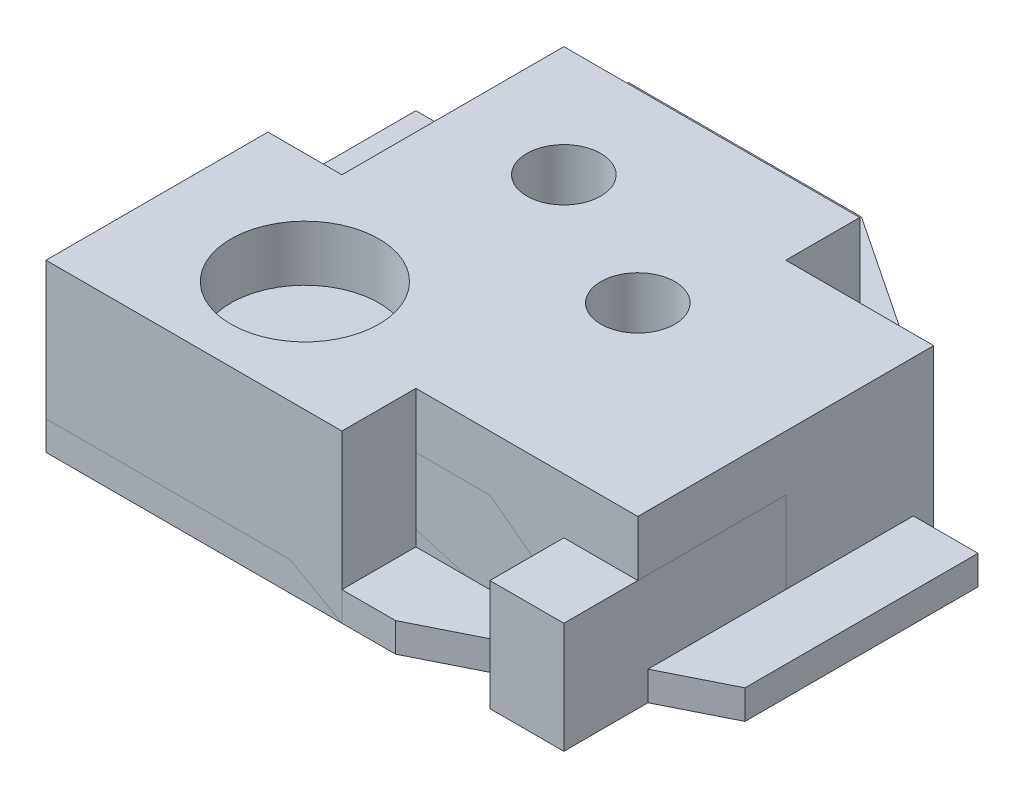
ISO-10303-21;
HEADER;
FILE_DESCRIPTION(('STEP AP214'),'2;1');
FILE_NAME('part.step','',(''),(''),'','','');
FILE_SCHEMA(('AUTOMOTIVE_DESIGN { 1 0 10303 214 1 1 1 1 }'));
ENDSEC;
DATA;
#1=APPLICATION_CONTEXT('core data for automotive mechanical design processes');
#2=APPLICATION_PROTOCOL_DEFINITION('international standard','automotive_design',2000,#1);
#3=PRODUCT_CONTEXT('',#1,'mechanical');
#4=PRODUCT('Part','Part','',(#3));
#5=PRODUCT_RELATED_PRODUCT_CATEGORY('part','',(#4));
#6=PRODUCT_DEFINITION_FORMATION('','',#4);
#7=PRODUCT_DEFINITION_CONTEXT('part definition',#1,'design');
#8=PRODUCT_DEFINITION('design','',#6,#7);
#9=PRODUCT_DEFINITION_SHAPE('','',#8);
#10=(LENGTH_UNIT() NAMED_UNIT(*) SI_UNIT(.MILLI.,.METRE.));
#11=(NAMED_UNIT(*) PLANE_ANGLE_UNIT() SI_UNIT($,.RADIAN.));
#12=(NAMED_UNIT(*) SI_UNIT($,.STERADIAN.) SOLID_ANGLE_UNIT());
#13=UNCERTAINTY_MEASURE_WITH_UNIT(LENGTH_MEASURE(1.E-05),#10,'distance_accuracy_value','');
#14=(GEOMETRIC_REPRESENTATION_CONTEXT(3) GLOBAL_UNCERTAINTY_ASSIGNED_CONTEXT((#13)) GLOBAL_UNIT_ASSIGNED_CONTEXT((#10,
#11,#12)) REPRESENTATION_CONTEXT('',''));
#15=CARTESIAN_POINT('',(0.,0.,0.));
#16=DIRECTION('',(0.,0.,1.));
#17=DIRECTION('',(1.,0.,0.));
#18=AXIS2_PLACEMENT_3D('',#15,#16,#17);
#19=CARTESIAN_POINT('',(0.,5.,0.));
#20=DIRECTION('',(0.,1.,0.));
#21=DIRECTION('',(0.,0.,1.));
#22=AXIS2_PLACEMENT_3D('',#19,#20,#21);
#23=PLANE('',#22);
#24=CARTESIAN_POINT('',(20.,5.,-20.));
#25=DIRECTION('',(0.,1.,0.));
#26=DIRECTION('',(0.,0.,1.));
#27=AXIS2_PLACEMENT_3D('',#24,#25,#26);
#28=CIRCLE('',#27,10.);
#29=CARTESIAN_POINT('',(20.,5.,-10.));
#30=VERTEX_POINT('',#29);
#31=EDGE_CURVE('E226',#30,#30,#28,.T.);
#32=ORIENTED_EDGE('',*,*,#31,.F.);
#33=EDGE_LOOP('',(#32));
#34=FACE_BOUND('',#33,.T.);
#35=DIRECTION('',(1.,0.,0.));
#36=VECTOR('',#35,1.);
#37=CARTESIAN_POINT('',(0.,5.,0.));
#38=LINE('',#37,#36);
#39=CARTESIAN_POINT('',(0.,5.,0.));
#40=VERTEX_POINT('',#39);
#41=CARTESIAN_POINT('',(60.,5.,0.));
#42=VERTEX_POINT('',#41);
#43=EDGE_CURVE('E177',#40,#42,#38,.T.);
#44=ORIENTED_EDGE('',*,*,#43,.T.);
#45=DIRECTION('',(0.894427190999916,0.,-0.447213595499958));
#46=VECTOR('',#45,1.);
#47=CARTESIAN_POINT('',(60.,5.,0.));
#48=LINE('',#47,#46);
#49=CARTESIAN_POINT('',(100.,5.,-20.));
#50=VERTEX_POINT('',#49);
#51=EDGE_CURVE('E113',#42,#50,#48,.T.);
#52=ORIENTED_EDGE('',*,*,#51,.T.);
#53=DIRECTION('',(0.,0.,-1.));
#54=VECTOR('',#53,1.);
#55=CARTESIAN_POINT('',(100.,5.,-20.));
#56=LINE('',#55,#54);
#57=CARTESIAN_POINT('',(100.,5.,-60.));
#58=VERTEX_POINT('',#57);
#59=EDGE_CURVE('E198',#50,#58,#56,.T.);
#60=ORIENTED_EDGE('',*,*,#59,.T.);
#61=DIRECTION('',(-1.,0.,0.));
#62=VECTOR('',#61,1.);
#63=CARTESIAN_POINT('',(100.,5.,-60.));
#64=LINE('',#63,#62);
#65=CARTESIAN_POINT('',(70.,5.,-60.));
#66=VERTEX_POINT('',#65);
#67=EDGE_CURVE('E212',#58,#66,#64,.T.);
#68=ORIENTED_EDGE('',*,*,#67,.T.);
#69=DIRECTION('',(0.,0.,-1.));
#70=VECTOR('',#69,1.);
#71=CARTESIAN_POINT('',(70.,5.,-60.));
#72=LINE('',#71,#70);
#73=CARTESIAN_POINT('',(70.,5.,-80.));
#74=VERTEX_POINT('',#73);
#75=EDGE_CURVE('E132',#66,#74,#72,.T.);
#76=ORIENTED_EDGE('',*,*,#75,.T.);
#77=DIRECTION('',(-0.832050294337844,0.,-0.554700196225229));
#78=VECTOR('',#77,1.);
#79=CARTESIAN_POINT('',(70.,5.,-80.));
#80=LINE('',#79,#78);
#81=CARTESIAN_POINT('',(40.,5.,-100.));
#82=VERTEX_POINT('',#81);
#83=EDGE_CURVE('E126',#74,#82,#80,.T.);
#84=ORIENTED_EDGE('',*,*,#83,.T.);
#85=DIRECTION('',(-1.,0.,0.));
#86=VECTOR('',#85,1.);
#87=CARTESIAN_POINT('',(0.,5.,-100.));
#88=LINE('',#87,#86);
#89=CARTESIAN_POINT('',(0.,5.,-100.));
#90=VERTEX_POINT('',#89);
#91=EDGE_CURVE('E130',#82,#90,#88,.T.);
#92=ORIENTED_EDGE('',*,*,#91,.T.);
#93=DIRECTION('',(0.,0.,1.));
#94=VECTOR('',#93,1.);
#95=CARTESIAN_POINT('',(0.,5.,0.));
#96=LINE('',#95,#94);
#97=EDGE_CURVE('E70',#90,#40,#96,.T.);
#98=ORIENTED_EDGE('',*,*,#97,.T.);
#99=EDGE_LOOP('',(#44,#52,#60,#68,#76,#84,#92,#98));
#100=FACE_BOUND('',#99,.T.);
#101=CARTESIAN_POINT('',(20.,5.,-80.));
#102=DIRECTION('',(0.,1.,0.));
#103=DIRECTION('',(0.,0.,1.));
#104=AXIS2_PLACEMENT_3D('',#101,#102,#103);
#105=CIRCLE('',#104,9.99999999999999);
#106=CARTESIAN_POINT('',(20.,5.,-70.));
#107=VERTEX_POINT('',#106);
#108=EDGE_CURVE('E159',#107,#107,#105,.T.);
#109=ORIENTED_EDGE('',*,*,#108,.F.);
#110=EDGE_LOOP('',(#109));
#111=FACE_BOUND('',#110,.T.);
#112=CARTESIAN_POINT('',(75.,5.,-30.));
#113=DIRECTION('',(0.,1.,0.));
#114=DIRECTION('',(0.,0.,1.));
#115=AXIS2_PLACEMENT_3D('',#112,#113,#114);
#116=CIRCLE('',#115,10.);
#117=CARTESIAN_POINT('',(75.,5.,-20.));
#118=VERTEX_POINT('',#117);
#119=EDGE_CURVE('E234',#118,#118,#116,.T.);
#120=ORIENTED_EDGE('',*,*,#119,.F.);
#121=EDGE_LOOP('',(#120));
#122=FACE_BOUND('',#121,.T.);
#123=ADVANCED_FACE('F52',(#34,#100,#111,#122),#23,.T.);
#124=CARTESIAN_POINT('',(0.,0.,0.));
#125=DIRECTION('',(0.,1.,0.));
#126=DIRECTION('',(0.,0.,1.));
#127=AXIS2_PLACEMENT_3D('',#124,#125,#126);
#128=PLANE('',#127);
#129=DIRECTION('',(1.,0.,0.));
#130=VECTOR('',#129,1.);
#131=CARTESIAN_POINT('',(0.,0.,0.));
#132=LINE('',#131,#130);
#133=CARTESIAN_POINT('',(0.,0.,0.));
#134=VERTEX_POINT('',#133);
#135=CARTESIAN_POINT('',(60.,0.,0.));
#136=VERTEX_POINT('',#135);
#137=EDGE_CURVE('E154',#134,#136,#132,.T.);
#138=ORIENTED_EDGE('',*,*,#137,.F.);
#139=DIRECTION('',(0.,0.,1.));
#140=VECTOR('',#139,1.);
#141=CARTESIAN_POINT('',(0.,0.,0.));
#142=LINE('',#141,#140);
#143=CARTESIAN_POINT('',(0.,0.,-100.));
#144=VERTEX_POINT('',#143);
#145=EDGE_CURVE('E105',#144,#134,#142,.T.);
#146=ORIENTED_EDGE('',*,*,#145,.F.);
#147=DIRECTION('',(-1.,0.,0.));
#148=VECTOR('',#147,1.);
#149=CARTESIAN_POINT('',(0.,0.,-100.));
#150=LINE('',#149,#148);
#151=CARTESIAN_POINT('',(40.,0.,-100.));
#152=VERTEX_POINT('',#151);
#153=EDGE_CURVE('E99',#152,#144,#150,.T.);
#154=ORIENTED_EDGE('',*,*,#153,.F.);
#155=DIRECTION('',(-0.832050294337844,0.,-0.554700196225229));
#156=VECTOR('',#155,1.);
#157=CARTESIAN_POINT('',(70.,0.,-80.));
#158=LINE('',#157,#156);
#159=CARTESIAN_POINT('',(70.,0.,-80.));
#160=VERTEX_POINT('',#159);
#161=EDGE_CURVE('E141',#160,#152,#158,.T.);
#162=ORIENTED_EDGE('',*,*,#161,.F.);
#163=DIRECTION('',(0.,0.,-1.));
#164=VECTOR('',#163,1.);
#165=CARTESIAN_POINT('',(70.,0.,-60.));
#166=LINE('',#165,#164);
#167=CARTESIAN_POINT('',(70.,0.,-60.));
#168=VERTEX_POINT('',#167);
#169=EDGE_CURVE('E168',#168,#160,#166,.T.);
#170=ORIENTED_EDGE('',*,*,#169,.F.);
#171=DIRECTION('',(-1.,0.,0.));
#172=VECTOR('',#171,1.);
#173=CARTESIAN_POINT('',(100.,0.,-60.));
#174=LINE('',#173,#172);
#175=CARTESIAN_POINT('',(100.,0.,-60.));
#176=VERTEX_POINT('',#175);
#177=EDGE_CURVE('E165',#176,#168,#174,.T.);
#178=ORIENTED_EDGE('',*,*,#177,.F.);
#179=DIRECTION('',(0.,0.,-1.));
#180=VECTOR('',#179,1.);
#181=CARTESIAN_POINT('',(100.,0.,-20.));
#182=LINE('',#181,#180);
#183=CARTESIAN_POINT('',(100.,0.,-20.));
#184=VERTEX_POINT('',#183);
#185=EDGE_CURVE('E162',#184,#176,#182,.T.);
#186=ORIENTED_EDGE('',*,*,#185,.F.);
#187=DIRECTION('',(0.894427190999916,0.,-0.447213595499958));
#188=VECTOR('',#187,1.);
#189=CARTESIAN_POINT('',(60.,0.,0.));
#190=LINE('',#189,#188);
#191=EDGE_CURVE('E158',#136,#184,#190,.T.);
#192=ORIENTED_EDGE('',*,*,#191,.F.);
#193=EDGE_LOOP('',(#138,#146,#154,#162,#170,#178,#186,#192));
#194=FACE_BOUND('',#193,.T.);
#195=CARTESIAN_POINT('',(20.,0.,-80.));
#196=DIRECTION('',(0.,1.,0.));
#197=DIRECTION('',(0.,0.,1.));
#198=AXIS2_PLACEMENT_3D('',#195,#196,#197);
#199=CIRCLE('',#198,9.99999999999999);
#200=CARTESIAN_POINT('',(20.,0.,-70.));
#201=VERTEX_POINT('',#200);
#202=EDGE_CURVE('E222',#201,#201,#199,.T.);
#203=ORIENTED_EDGE('',*,*,#202,.T.);
#204=EDGE_LOOP('',(#203));
#205=FACE_BOUND('',#204,.T.);
#206=CARTESIAN_POINT('',(20.,0.,-20.));
#207=DIRECTION('',(0.,1.,0.));
#208=DIRECTION('',(0.,0.,1.));
#209=AXIS2_PLACEMENT_3D('',#206,#207,#208);
#210=CIRCLE('',#209,10.);
#211=CARTESIAN_POINT('',(20.,0.,-10.));
#212=VERTEX_POINT('',#211);
#213=EDGE_CURVE('E230',#212,#212,#210,.T.);
#214=ORIENTED_EDGE('',*,*,#213,.T.);
#215=EDGE_LOOP('',(#214));
#216=FACE_BOUND('',#215,.T.);
#217=CARTESIAN_POINT('',(75.,0.,-30.));
#218=DIRECTION('',(0.,1.,0.));
#219=DIRECTION('',(0.,0.,1.));
#220=AXIS2_PLACEMENT_3D('',#217,#218,#219);
#221=CIRCLE('',#220,10.);
#222=CARTESIAN_POINT('',(75.,0.,-20.));
#223=VERTEX_POINT('',#222);
#224=EDGE_CURVE('E238',#223,#223,#221,.T.);
#225=ORIENTED_EDGE('',*,*,#224,.T.);
#226=EDGE_LOOP('',(#225));
#227=FACE_BOUND('',#226,.T.);
#228=ADVANCED_FACE('F202',(#194,#205,#216,#227),#128,.F.);
#229=CARTESIAN_POINT('',(0.,5.,0.));
#230=DIRECTION('',(0.,0.,-1.));
#231=DIRECTION('',(-1.,0.,0.));
#232=AXIS2_PLACEMENT_3D('',#229,#230,#231);
#233=PLANE('',#232);
#234=ORIENTED_EDGE('',*,*,#137,.T.);
#235=DIRECTION('',(0.,-1.,0.));
#236=VECTOR('',#235,1.);
#237=CARTESIAN_POINT('',(60.,5.,0.));
#238=LINE('',#237,#236);
#239=EDGE_CURVE('E12',#42,#136,#238,.T.);
#240=ORIENTED_EDGE('',*,*,#239,.F.);
#241=ORIENTED_EDGE('',*,*,#43,.F.);
#242=DIRECTION('',(0.,-1.,0.));
#243=VECTOR('',#242,1.);
#244=CARTESIAN_POINT('',(0.,5.,0.));
#245=LINE('',#244,#243);
#246=EDGE_CURVE('E150',#40,#134,#245,.T.);
#247=ORIENTED_EDGE('',*,*,#246,.T.);
#248=EDGE_LOOP('',(#234,#240,#241,#247));
#249=FACE_BOUND('',#248,.T.);
#250=ADVANCED_FACE('F54',(#249),#233,.F.);
#251=CARTESIAN_POINT('',(60.,5.,0.));
#252=DIRECTION('',(-0.447213595499958,0.,-0.894427190999916));
#253=DIRECTION('',(-0.894427190999916,0.,0.447213595499958));
#254=AXIS2_PLACEMENT_3D('',#251,#252,#253);
#255=PLANE('',#254);
#256=ORIENTED_EDGE('',*,*,#191,.T.);
#257=DIRECTION('',(0.,-1.,0.));
#258=VECTOR('',#257,1.);
#259=CARTESIAN_POINT('',(100.,5.,-20.));
#260=LINE('',#259,#258);
#261=EDGE_CURVE('E62',#50,#184,#260,.T.);
#262=ORIENTED_EDGE('',*,*,#261,.F.);
#263=ORIENTED_EDGE('',*,*,#51,.F.);
#264=ORIENTED_EDGE('',*,*,#239,.T.);
#265=EDGE_LOOP('',(#256,#262,#263,#264));
#266=FACE_BOUND('',#265,.T.);
#267=ADVANCED_FACE('F273',(#266),#255,.F.);
#268=CARTESIAN_POINT('',(100.,5.,-20.));
#269=DIRECTION('',(-1.,0.,0.));
#270=DIRECTION('',(0.,0.,1.));
#271=AXIS2_PLACEMENT_3D('',#268,#269,#270);
#272=PLANE('',#271);
#273=ORIENTED_EDGE('',*,*,#185,.T.);
#274=DIRECTION('',(0.,-1.,0.));
#275=VECTOR('',#274,1.);
#276=CARTESIAN_POINT('',(100.,5.,-60.));
#277=LINE('',#276,#275);
#278=EDGE_CURVE('E188',#58,#176,#277,.T.);
#279=ORIENTED_EDGE('',*,*,#278,.F.);
#280=ORIENTED_EDGE('',*,*,#59,.F.);
#281=ORIENTED_EDGE('',*,*,#261,.T.);
#282=EDGE_LOOP('',(#273,#279,#280,#281));
#283=FACE_BOUND('',#282,.T.);
#284=ADVANCED_FACE('F196',(#283),#272,.F.);
#285=CARTESIAN_POINT('',(100.,5.,-60.));
#286=DIRECTION('',(0.,0.,1.));
#287=DIRECTION('',(1.,0.,0.));
#288=AXIS2_PLACEMENT_3D('',#285,#286,#287);
#289=PLANE('',#288);
#290=ORIENTED_EDGE('',*,*,#177,.T.);
#291=DIRECTION('',(0.,-1.,0.));
#292=VECTOR('',#291,1.);
#293=CARTESIAN_POINT('',(70.,5.,-60.));
#294=LINE('',#293,#292);
#295=EDGE_CURVE('E184',#66,#168,#294,.T.);
#296=ORIENTED_EDGE('',*,*,#295,.F.);
#297=ORIENTED_EDGE('',*,*,#67,.F.);
#298=ORIENTED_EDGE('',*,*,#278,.T.);
#299=EDGE_LOOP('',(#290,#296,#297,#298));
#300=FACE_BOUND('',#299,.T.);
#301=ADVANCED_FACE('F207',(#300),#289,.F.);
#302=CARTESIAN_POINT('',(70.,5.,-60.));
#303=DIRECTION('',(-1.,0.,0.));
#304=DIRECTION('',(0.,0.,1.));
#305=AXIS2_PLACEMENT_3D('',#302,#303,#304);
#306=PLANE('',#305);
#307=ORIENTED_EDGE('',*,*,#169,.T.);
#308=DIRECTION('',(0.,-1.,0.));
#309=VECTOR('',#308,1.);
#310=CARTESIAN_POINT('',(70.,5.,-80.));
#311=LINE('',#310,#309);
#312=EDGE_CURVE('E143',#74,#160,#311,.T.);
#313=ORIENTED_EDGE('',*,*,#312,.F.);
#314=ORIENTED_EDGE('',*,*,#75,.F.);
#315=ORIENTED_EDGE('',*,*,#295,.T.);
#316=EDGE_LOOP('',(#307,#313,#314,#315));
#317=FACE_BOUND('',#316,.T.);
#318=ADVANCED_FACE('F210',(#317),#306,.F.);
#319=CARTESIAN_POINT('',(70.,5.,-80.));
#320=DIRECTION('',(-0.554700196225229,0.,0.832050294337844));
#321=DIRECTION('',(0.832050294337844,0.,0.554700196225229));
#322=AXIS2_PLACEMENT_3D('',#319,#320,#321);
#323=PLANE('',#322);
#324=ORIENTED_EDGE('',*,*,#161,.T.);
#325=DIRECTION('',(0.,-1.,0.));
#326=VECTOR('',#325,1.);
#327=CARTESIAN_POINT('',(40.,5.,-100.));
#328=LINE('',#327,#326);
#329=EDGE_CURVE('E138',#82,#152,#328,.T.);
#330=ORIENTED_EDGE('',*,*,#329,.F.);
#331=ORIENTED_EDGE('',*,*,#83,.F.);
#332=ORIENTED_EDGE('',*,*,#312,.T.);
#333=EDGE_LOOP('',(#324,#330,#331,#332));
#334=FACE_BOUND('',#333,.T.);
#335=ADVANCED_FACE('F139',(#334),#323,.F.);
#336=CARTESIAN_POINT('',(0.,5.,-100.));
#337=DIRECTION('',(0.,0.,1.));
#338=DIRECTION('',(1.,0.,0.));
#339=AXIS2_PLACEMENT_3D('',#336,#337,#338);
#340=PLANE('',#339);
#341=ORIENTED_EDGE('',*,*,#153,.T.);
#342=DIRECTION('',(0.,-1.,0.));
#343=VECTOR('',#342,1.);
#344=CARTESIAN_POINT('',(0.,5.,-100.));
#345=LINE('',#344,#343);
#346=EDGE_CURVE('E144',#90,#144,#345,.T.);
#347=ORIENTED_EDGE('',*,*,#346,.F.);
#348=ORIENTED_EDGE('',*,*,#91,.F.);
#349=ORIENTED_EDGE('',*,*,#329,.T.);
#350=EDGE_LOOP('',(#341,#347,#348,#349));
#351=FACE_BOUND('',#350,.T.);
#352=ADVANCED_FACE('F146',(#351),#340,.F.);
#353=CARTESIAN_POINT('',(0.,5.,0.));
#354=DIRECTION('',(1.,0.,0.));
#355=DIRECTION('',(0.,0.,-1.));
#356=AXIS2_PLACEMENT_3D('',#353,#354,#355);
#357=PLANE('',#356);
#358=ORIENTED_EDGE('',*,*,#145,.T.);
#359=ORIENTED_EDGE('',*,*,#246,.F.);
#360=ORIENTED_EDGE('',*,*,#97,.F.);
#361=ORIENTED_EDGE('',*,*,#346,.T.);
#362=EDGE_LOOP('',(#358,#359,#360,#361));
#363=FACE_BOUND('',#362,.T.);
#364=ADVANCED_FACE('F261',(#363),#357,.F.);
#365=CARTESIAN_POINT('',(20.,5.,-80.));
#366=DIRECTION('',(0.,-1.,0.));
#367=DIRECTION('',(0.,0.,-1.));
#368=AXIS2_PLACEMENT_3D('',#365,#366,#367);
#369=CYLINDRICAL_SURFACE('',#368,9.99999999999999);
#370=ORIENTED_EDGE('',*,*,#108,.T.);
#371=EDGE_LOOP('',(#370));
#372=FACE_BOUND('',#371,.T.);
#373=ORIENTED_EDGE('',*,*,#202,.F.);
#374=EDGE_LOOP('',(#373));
#375=FACE_BOUND('',#374,.T.);
#376=ADVANCED_FACE('F258',(#372,#375),#369,.F.);
#377=CARTESIAN_POINT('',(20.,5.,-20.));
#378=DIRECTION('',(0.,-1.,0.));
#379=DIRECTION('',(0.,0.,-1.));
#380=AXIS2_PLACEMENT_3D('',#377,#378,#379);
#381=CYLINDRICAL_SURFACE('',#380,10.);
#382=ORIENTED_EDGE('',*,*,#31,.T.);
#383=EDGE_LOOP('',(#382));
#384=FACE_BOUND('',#383,.T.);
#385=ORIENTED_EDGE('',*,*,#213,.F.);
#386=EDGE_LOOP('',(#385));
#387=FACE_BOUND('',#386,.T.);
#388=ADVANCED_FACE('F337',(#384,#387),#381,.F.);
#389=CARTESIAN_POINT('',(75.,5.,-30.));
#390=DIRECTION('',(0.,-1.,0.));
#391=DIRECTION('',(0.,0.,-1.));
#392=AXIS2_PLACEMENT_3D('',#389,#390,#391);
#393=CYLINDRICAL_SURFACE('',#392,10.);
#394=ORIENTED_EDGE('',*,*,#119,.T.);
#395=EDGE_LOOP('',(#394));
#396=FACE_BOUND('',#395,.T.);
#397=ORIENTED_EDGE('',*,*,#224,.F.);
#398=EDGE_LOOP('',(#397));
#399=FACE_BOUND('',#398,.T.);
#400=ADVANCED_FACE('F246',(#396,#399),#393,.F.);
#401=CLOSED_SHELL('',(#123,#228,#250,#267,#284,#301,#318,#335,#352,#364,#376,#388,#400));
#402=MANIFOLD_SOLID_BREP('B2',#401);
#403=CARTESIAN_POINT('',(0.,28.575,0.));
#404=DIRECTION('',(0.,1.,0.));
#405=DIRECTION('',(0.,0.,1.));
#406=AXIS2_PLACEMENT_3D('',#403,#404,#405);
#407=PLANE('',#406);
#408=CARTESIAN_POINT('',(57.15,28.575,-44.45));
#409=DIRECTION('',(0.,1.,0.));
#410=DIRECTION('',(0.,0.,1.));
#411=AXIS2_PLACEMENT_3D('',#408,#409,#410);
#412=CIRCLE('',#411,6.35);
#413=CARTESIAN_POINT('',(57.15,28.575,-38.1));
#414=VERTEX_POINT('',#413);
#415=EDGE_CURVE('E560',#414,#414,#412,.T.);
#416=ORIENTED_EDGE('',*,*,#415,.F.);
#417=EDGE_LOOP('',(#416));
#418=FACE_BOUND('',#417,.T.);
#419=DIRECTION('',(1.,0.,0.));
#420=VECTOR('',#419,1.);
#421=CARTESIAN_POINT('',(0.,28.575,0.));
#422=LINE('',#421,#420);
#423=CARTESIAN_POINT('',(0.,28.575,0.));
#424=VERTEX_POINT('',#423);
#425=CARTESIAN_POINT('',(50.8,28.575,0.));
#426=VERTEX_POINT('',#425);
#427=EDGE_CURVE('E509',#424,#426,#422,.T.);
#428=ORIENTED_EDGE('',*,*,#427,.T.);
#429=DIRECTION('',(0.,0.,-1.));
#430=VECTOR('',#429,1.);
#431=CARTESIAN_POINT('',(50.8,28.575,0.));
#432=LINE('',#431,#430);
#433=CARTESIAN_POINT('',(50.8,28.575,-12.7));
#434=VERTEX_POINT('',#433);
#435=EDGE_CURVE('E447',#426,#434,#432,.T.);
#436=ORIENTED_EDGE('',*,*,#435,.T.);
#437=DIRECTION('',(1.,0.,0.));
#438=VECTOR('',#437,1.);
#439=CARTESIAN_POINT('',(50.8,28.575,-12.7));
#440=LINE('',#439,#438);
#441=CARTESIAN_POINT('',(88.9,28.575,-12.7));
#442=VERTEX_POINT('',#441);
#443=EDGE_CURVE('E530',#434,#442,#440,.T.);
#444=ORIENTED_EDGE('',*,*,#443,.T.);
#445=DIRECTION('',(0.,0.,-1.));
#446=VECTOR('',#445,1.);
#447=CARTESIAN_POINT('',(88.9,28.575,-12.7));
#448=LINE('',#447,#446);
#449=CARTESIAN_POINT('',(88.9,28.575,-63.5));
#450=VERTEX_POINT('',#449);
#451=EDGE_CURVE('E549',#442,#450,#448,.T.);
#452=ORIENTED_EDGE('',*,*,#451,.T.);
#453=DIRECTION('',(-1.,0.,0.));
#454=VECTOR('',#453,1.);
#455=CARTESIAN_POINT('',(88.9,28.575,-63.5));
#456=LINE('',#455,#454);
#457=CARTESIAN_POINT('',(63.5,28.575,-63.5));
#458=VERTEX_POINT('',#457);
#459=EDGE_CURVE('E546',#450,#458,#456,.T.);
#460=ORIENTED_EDGE('',*,*,#459,.T.);
#461=DIRECTION('',(0.,0.,-1.));
#462=VECTOR('',#461,1.);
#463=CARTESIAN_POINT('',(63.5,28.575,-63.5));
#464=LINE('',#463,#462);
#465=CARTESIAN_POINT('',(63.5,28.575,-76.2));
#466=VERTEX_POINT('',#465);
#467=EDGE_CURVE('E548',#458,#466,#464,.T.);
#468=ORIENTED_EDGE('',*,*,#467,.T.);
#469=DIRECTION('',(-1.,0.,0.));
#470=VECTOR('',#469,1.);
#471=CARTESIAN_POINT('',(63.5,28.575,-76.2));
#472=LINE('',#471,#470);
#473=CARTESIAN_POINT('',(12.7,28.575,-76.2));
#474=VERTEX_POINT('',#473);
#475=EDGE_CURVE('E472',#466,#474,#472,.T.);
#476=ORIENTED_EDGE('',*,*,#475,.T.);
#477=DIRECTION('',(0.,0.,1.));
#478=VECTOR('',#477,1.);
#479=CARTESIAN_POINT('',(12.7,28.575,-38.1));
#480=LINE('',#479,#478);
#481=CARTESIAN_POINT('',(12.7,28.575,-38.1));
#482=VERTEX_POINT('',#481);
#483=EDGE_CURVE('E466',#474,#482,#480,.T.);
#484=ORIENTED_EDGE('',*,*,#483,.T.);
#485=DIRECTION('',(-1.,0.,0.));
#486=VECTOR('',#485,1.);
#487=CARTESIAN_POINT('',(0.,28.575,-38.1));
#488=LINE('',#487,#486);
#489=CARTESIAN_POINT('',(0.,28.575,-38.1));
#490=VERTEX_POINT('',#489);
#491=EDGE_CURVE('E470',#482,#490,#488,.T.);
#492=ORIENTED_EDGE('',*,*,#491,.T.);
#493=DIRECTION('',(0.,0.,1.));
#494=VECTOR('',#493,1.);
#495=CARTESIAN_POINT('',(0.,28.575,0.));
#496=LINE('',#495,#494);
#497=EDGE_CURVE('E398',#490,#424,#496,.T.);
#498=ORIENTED_EDGE('',*,*,#497,.T.);
#499=EDGE_LOOP('',(#428,#436,#444,#452,#460,#468,#476,#484,#492,#498));
#500=FACE_BOUND('',#499,.T.);
#501=CARTESIAN_POINT('',(25.4,28.575,-19.05));
#502=DIRECTION('',(0.,1.,0.));
#503=DIRECTION('',(0.,0.,1.));
#504=AXIS2_PLACEMENT_3D('',#501,#502,#503);
#505=CIRCLE('',#504,12.7);
#506=CARTESIAN_POINT('',(25.4,28.575,-6.35));
#507=VERTEX_POINT('',#506);
#508=EDGE_CURVE('E494',#507,#507,#505,.T.);
#509=ORIENTED_EDGE('',*,*,#508,.F.);
#510=EDGE_LOOP('',(#509));
#511=FACE_BOUND('',#510,.T.);
#512=CARTESIAN_POINT('',(31.75,28.575,-57.15));
#513=DIRECTION('',(0.,1.,0.));
#514=DIRECTION('',(0.,0.,1.));
#515=AXIS2_PLACEMENT_3D('',#512,#513,#514);
#516=CIRCLE('',#515,6.35);
#517=CARTESIAN_POINT('',(31.75,28.575,-50.8));
#518=VERTEX_POINT('',#517);
#519=EDGE_CURVE('E566',#518,#518,#516,.T.);
#520=ORIENTED_EDGE('',*,*,#519,.F.);
#521=EDGE_LOOP('',(#520));
#522=FACE_BOUND('',#521,.T.);
#523=ADVANCED_FACE('F381',(#418,#500,#511,#522),#407,.T.);
#524=CARTESIAN_POINT('',(0.,0.,0.));
#525=DIRECTION('',(0.,1.,0.));
#526=DIRECTION('',(0.,0.,1.));
#527=AXIS2_PLACEMENT_3D('',#524,#525,#526);
#528=PLANE('',#527);
#529=DIRECTION('',(1.,0.,0.));
#530=VECTOR('',#529,1.);
#531=CARTESIAN_POINT('',(0.,0.,0.));
#532=LINE('',#531,#530);
#533=CARTESIAN_POINT('',(0.,0.,0.));
#534=VERTEX_POINT('',#533);
#535=CARTESIAN_POINT('',(50.8,0.,0.));
#536=VERTEX_POINT('',#535);
#537=EDGE_CURVE('E490',#534,#536,#532,.T.);
#538=ORIENTED_EDGE('',*,*,#537,.F.);
#539=DIRECTION('',(0.,0.,1.));
#540=VECTOR('',#539,1.);
#541=CARTESIAN_POINT('',(0.,0.,0.));
#542=LINE('',#541,#540);
#543=CARTESIAN_POINT('',(0.,0.,-38.1));
#544=VERTEX_POINT('',#543);
#545=EDGE_CURVE('E439',#544,#534,#542,.T.);
#546=ORIENTED_EDGE('',*,*,#545,.F.);
#547=DIRECTION('',(-1.,0.,0.));
#548=VECTOR('',#547,1.);
#549=CARTESIAN_POINT('',(0.,0.,-38.1));
#550=LINE('',#549,#548);
#551=CARTESIAN_POINT('',(12.7,0.,-38.1));
#552=VERTEX_POINT('',#551);
#553=EDGE_CURVE('E433',#552,#544,#550,.T.);
#554=ORIENTED_EDGE('',*,*,#553,.F.);
#555=DIRECTION('',(0.,0.,1.));
#556=VECTOR('',#555,1.);
#557=CARTESIAN_POINT('',(12.7,0.,-38.1));
#558=LINE('',#557,#556);
#559=CARTESIAN_POINT('',(12.7,0.,-76.2));
#560=VERTEX_POINT('',#559);
#561=EDGE_CURVE('E480',#560,#552,#558,.T.);
#562=ORIENTED_EDGE('',*,*,#561,.F.);
#563=DIRECTION('',(-1.,0.,0.));
#564=VECTOR('',#563,1.);
#565=CARTESIAN_POINT('',(63.5,0.,-76.2));
#566=LINE('',#565,#564);
#567=CARTESIAN_POINT('',(63.5,0.,-76.2));
#568=VERTEX_POINT('',#567);
#569=EDGE_CURVE('E504',#568,#560,#566,.T.);
#570=ORIENTED_EDGE('',*,*,#569,.F.);
#571=DIRECTION('',(0.,0.,-1.));
#572=VECTOR('',#571,1.);
#573=CARTESIAN_POINT('',(63.5,0.,-63.5));
#574=LINE('',#573,#572);
#575=CARTESIAN_POINT('',(63.5,0.,-63.5));
#576=VERTEX_POINT('',#575);
#577=EDGE_CURVE('E502',#576,#568,#574,.T.);
#578=ORIENTED_EDGE('',*,*,#577,.F.);
#579=DIRECTION('',(-1.,0.,0.));
#580=VECTOR('',#579,1.);
#581=CARTESIAN_POINT('',(88.9,0.,-63.5));
#582=LINE('',#581,#580);
#583=CARTESIAN_POINT('',(88.9,0.,-63.5));
#584=VERTEX_POINT('',#583);
#585=EDGE_CURVE('E500',#584,#576,#582,.T.);
#586=ORIENTED_EDGE('',*,*,#585,.F.);
#587=DIRECTION('',(0.,0.,-1.));
#588=VECTOR('',#587,1.);
#589=CARTESIAN_POINT('',(88.9,0.,-12.7));
#590=LINE('',#589,#588);
#591=CARTESIAN_POINT('',(88.9,0.,-12.7));
#592=VERTEX_POINT('',#591);
#593=EDGE_CURVE('E498',#592,#584,#590,.T.);
#594=ORIENTED_EDGE('',*,*,#593,.F.);
#595=DIRECTION('',(1.,0.,0.));
#596=VECTOR('',#595,1.);
#597=CARTESIAN_POINT('',(50.8,0.,-12.7));
#598=LINE('',#597,#596);
#599=CARTESIAN_POINT('',(50.8,0.,-12.7));
#600=VERTEX_POINT('',#599);
#601=EDGE_CURVE('E496',#600,#592,#598,.T.);
#602=ORIENTED_EDGE('',*,*,#601,.F.);
#603=DIRECTION('',(0.,0.,-1.));
#604=VECTOR('',#603,1.);
#605=CARTESIAN_POINT('',(50.8,0.,0.));
#606=LINE('',#605,#604);
#607=EDGE_CURVE('E493',#536,#600,#606,.T.);
#608=ORIENTED_EDGE('',*,*,#607,.F.);
#609=EDGE_LOOP('',(#538,#546,#554,#562,#570,#578,#586,#594,#602,#608));
#610=FACE_BOUND('',#609,.T.);
#611=CARTESIAN_POINT('',(25.4,0.,-19.05));
#612=DIRECTION('',(0.,1.,0.));
#613=DIRECTION('',(0.,0.,1.));
#614=AXIS2_PLACEMENT_3D('',#611,#612,#613);
#615=CIRCLE('',#614,12.7);
#616=CARTESIAN_POINT('',(25.4,0.,-6.35));
#617=VERTEX_POINT('',#616);
#618=EDGE_CURVE('E557',#617,#617,#615,.T.);
#619=ORIENTED_EDGE('',*,*,#618,.T.);
#620=EDGE_LOOP('',(#619));
#621=FACE_BOUND('',#620,.T.);
#622=CARTESIAN_POINT('',(57.15,0.,-44.45));
#623=DIRECTION('',(0.,1.,0.));
#624=DIRECTION('',(0.,0.,1.));
#625=AXIS2_PLACEMENT_3D('',#622,#623,#624);
#626=CIRCLE('',#625,6.35);
#627=CARTESIAN_POINT('',(57.15,0.,-38.1));
#628=VERTEX_POINT('',#627);
#629=EDGE_CURVE('E563',#628,#628,#626,.T.);
#630=ORIENTED_EDGE('',*,*,#629,.T.);
#631=EDGE_LOOP('',(#630));
#632=FACE_BOUND('',#631,.T.);
#633=CARTESIAN_POINT('',(31.75,0.,-57.15));
#634=DIRECTION('',(0.,1.,0.));
#635=DIRECTION('',(0.,0.,1.));
#636=AXIS2_PLACEMENT_3D('',#633,#634,#635);
#637=CIRCLE('',#636,6.35);
#638=CARTESIAN_POINT('',(31.75,0.,-50.8));
#639=VERTEX_POINT('',#638);
#640=EDGE_CURVE('E569',#639,#639,#637,.T.);
#641=ORIENTED_EDGE('',*,*,#640,.T.);
#642=EDGE_LOOP('',(#641));
#643=FACE_BOUND('',#642,.T.);
#644=ADVANCED_FACE('F534',(#610,#621,#632,#643),#528,.F.);
#645=CARTESIAN_POINT('',(0.,28.575,0.));
#646=DIRECTION('',(0.,0.,-1.));
#647=DIRECTION('',(-1.,0.,0.));
#648=AXIS2_PLACEMENT_3D('',#645,#646,#647);
#649=PLANE('',#648);
#650=ORIENTED_EDGE('',*,*,#537,.T.);
#651=DIRECTION('',(0.,-1.,0.));
#652=VECTOR('',#651,1.);
#653=CARTESIAN_POINT('',(50.8,28.575,0.));
#654=LINE('',#653,#652);
#655=EDGE_CURVE('E50',#426,#536,#654,.T.);
#656=ORIENTED_EDGE('',*,*,#655,.F.);
#657=ORIENTED_EDGE('',*,*,#427,.F.);
#658=DIRECTION('',(0.,-1.,0.));
#659=VECTOR('',#658,1.);
#660=CARTESIAN_POINT('',(0.,28.575,0.));
#661=LINE('',#660,#659);
#662=EDGE_CURVE('E486',#424,#534,#661,.T.);
#663=ORIENTED_EDGE('',*,*,#662,.T.);
#664=EDGE_LOOP('',(#650,#656,#657,#663));
#665=FACE_BOUND('',#664,.T.);
#666=ADVANCED_FACE('F383',(#665),#649,.F.);
#667=CARTESIAN_POINT('',(50.8,28.575,0.));
#668=DIRECTION('',(-1.,0.,0.));
#669=DIRECTION('',(0.,0.,1.));
#670=AXIS2_PLACEMENT_3D('',#667,#668,#669);
#671=PLANE('',#670);
#672=ORIENTED_EDGE('',*,*,#607,.T.);
#673=DIRECTION('',(0.,-1.,0.));
#674=VECTOR('',#673,1.);
#675=CARTESIAN_POINT('',(50.8,28.575,-12.7));
#676=LINE('',#675,#674);
#677=EDGE_CURVE('E390',#434,#600,#676,.T.);
#678=ORIENTED_EDGE('',*,*,#677,.F.);
#679=ORIENTED_EDGE('',*,*,#435,.F.);
#680=ORIENTED_EDGE('',*,*,#655,.T.);
#681=EDGE_LOOP('',(#672,#678,#679,#680));
#682=FACE_BOUND('',#681,.T.);
#683=ADVANCED_FACE('F610',(#682),#671,.F.);
#684=CARTESIAN_POINT('',(50.8,28.575,-12.7));
#685=DIRECTION('',(0.,0.,-1.));
#686=DIRECTION('',(-1.,0.,0.));
#687=AXIS2_PLACEMENT_3D('',#684,#685,#686);
#688=PLANE('',#687);
#689=ORIENTED_EDGE('',*,*,#601,.T.);
#690=DIRECTION('',(0.,-1.,0.));
#691=VECTOR('',#690,1.);
#692=CARTESIAN_POINT('',(88.9,28.575,-12.7));
#693=LINE('',#692,#691);
#694=EDGE_CURVE('E522',#442,#592,#693,.T.);
#695=ORIENTED_EDGE('',*,*,#694,.F.);
#696=ORIENTED_EDGE('',*,*,#443,.F.);
#697=ORIENTED_EDGE('',*,*,#677,.T.);
#698=EDGE_LOOP('',(#689,#695,#696,#697));
#699=FACE_BOUND('',#698,.T.);
#700=ADVANCED_FACE('F528',(#699),#688,.F.);
#701=CARTESIAN_POINT('',(88.9,28.575,-12.7));
#702=DIRECTION('',(-1.,0.,0.));
#703=DIRECTION('',(0.,0.,1.));
#704=AXIS2_PLACEMENT_3D('',#701,#702,#703);
#705=PLANE('',#704);
#706=ORIENTED_EDGE('',*,*,#593,.T.);
#707=DIRECTION('',(0.,-1.,0.));
#708=VECTOR('',#707,1.);
#709=CARTESIAN_POINT('',(88.9,28.575,-63.5));
#710=LINE('',#709,#708);
#711=EDGE_CURVE('E519',#450,#584,#710,.T.);
#712=ORIENTED_EDGE('',*,*,#711,.F.);
#713=ORIENTED_EDGE('',*,*,#451,.F.);
#714=ORIENTED_EDGE('',*,*,#694,.T.);
#715=EDGE_LOOP('',(#706,#712,#713,#714));
#716=FACE_BOUND('',#715,.T.);
#717=ADVANCED_FACE('F540',(#716),#705,.F.);
#718=CARTESIAN_POINT('',(88.9,28.575,-63.5));
#719=DIRECTION('',(0.,0.,1.));
#720=DIRECTION('',(1.,0.,0.));
#721=AXIS2_PLACEMENT_3D('',#718,#719,#720);
#722=PLANE('',#721);
#723=ORIENTED_EDGE('',*,*,#585,.T.);
#724=DIRECTION('',(0.,-1.,0.));
#725=VECTOR('',#724,1.);
#726=CARTESIAN_POINT('',(63.5,28.575,-63.5));
#727=LINE('',#726,#725);
#728=EDGE_CURVE('E516',#458,#576,#727,.T.);
#729=ORIENTED_EDGE('',*,*,#728,.F.);
#730=ORIENTED_EDGE('',*,*,#459,.F.);
#731=ORIENTED_EDGE('',*,*,#711,.T.);
#732=EDGE_LOOP('',(#723,#729,#730,#731));
#733=FACE_BOUND('',#732,.T.);
#734=ADVANCED_FACE('F544',(#733),#722,.F.);
#735=CARTESIAN_POINT('',(63.5,28.575,-63.5));
#736=DIRECTION('',(-1.,0.,0.));
#737=DIRECTION('',(0.,0.,1.));
#738=AXIS2_PLACEMENT_3D('',#735,#736,#737);
#739=PLANE('',#738);
#740=ORIENTED_EDGE('',*,*,#577,.T.);
#741=DIRECTION('',(0.,-1.,0.));
#742=VECTOR('',#741,1.);
#743=CARTESIAN_POINT('',(63.5,28.575,-76.2));
#744=LINE('',#743,#742);
#745=EDGE_CURVE('E513',#466,#568,#744,.T.);
#746=ORIENTED_EDGE('',*,*,#745,.F.);
#747=ORIENTED_EDGE('',*,*,#467,.F.);
#748=ORIENTED_EDGE('',*,*,#728,.T.);
#749=EDGE_LOOP('',(#740,#746,#747,#748));
#750=FACE_BOUND('',#749,.T.);
#751=ADVANCED_FACE('F600',(#750),#739,.F.);
#752=CARTESIAN_POINT('',(63.5,28.575,-76.2));
#753=DIRECTION('',(0.,0.,1.));
#754=DIRECTION('',(1.,0.,0.));
#755=AXIS2_PLACEMENT_3D('',#752,#753,#754);
#756=PLANE('',#755);
#757=ORIENTED_EDGE('',*,*,#569,.T.);
#758=DIRECTION('',(0.,-1.,0.));
#759=VECTOR('',#758,1.);
#760=CARTESIAN_POINT('',(12.7,28.575,-76.2));
#761=LINE('',#760,#759);
#762=EDGE_CURVE('E481',#474,#560,#761,.T.);
#763=ORIENTED_EDGE('',*,*,#762,.F.);
#764=ORIENTED_EDGE('',*,*,#475,.F.);
#765=ORIENTED_EDGE('',*,*,#745,.T.);
#766=EDGE_LOOP('',(#757,#763,#764,#765));
#767=FACE_BOUND('',#766,.T.);
#768=ADVANCED_FACE('F597',(#767),#756,.F.);
#769=CARTESIAN_POINT('',(12.7,28.575,-38.1));
#770=DIRECTION('',(1.,0.,0.));
#771=DIRECTION('',(0.,0.,-1.));
#772=AXIS2_PLACEMENT_3D('',#769,#770,#771);
#773=PLANE('',#772);
#774=ORIENTED_EDGE('',*,*,#561,.T.);
#775=DIRECTION('',(0.,-1.,0.));
#776=VECTOR('',#775,1.);
#777=CARTESIAN_POINT('',(12.7,28.575,-38.1));
#778=LINE('',#777,#776);
#779=EDGE_CURVE('E477',#482,#552,#778,.T.);
#780=ORIENTED_EDGE('',*,*,#779,.F.);
#781=ORIENTED_EDGE('',*,*,#483,.F.);
#782=ORIENTED_EDGE('',*,*,#762,.T.);
#783=EDGE_LOOP('',(#774,#780,#781,#782));
#784=FACE_BOUND('',#783,.T.);
#785=ADVANCED_FACE('F478',(#784),#773,.F.);
#786=CARTESIAN_POINT('',(0.,28.575,-38.1));
#787=DIRECTION('',(0.,0.,1.));
#788=DIRECTION('',(1.,0.,0.));
#789=AXIS2_PLACEMENT_3D('',#786,#787,#788);
#790=PLANE('',#789);
#791=ORIENTED_EDGE('',*,*,#553,.T.);
#792=DIRECTION('',(0.,-1.,0.));
#793=VECTOR('',#792,1.);
#794=CARTESIAN_POINT('',(0.,28.575,-38.1));
#795=LINE('',#794,#793);
#796=EDGE_CURVE('E482',#490,#544,#795,.T.);
#797=ORIENTED_EDGE('',*,*,#796,.F.);
#798=ORIENTED_EDGE('',*,*,#491,.F.);
#799=ORIENTED_EDGE('',*,*,#779,.T.);
#800=EDGE_LOOP('',(#791,#797,#798,#799));
#801=FACE_BOUND('',#800,.T.);
#802=ADVANCED_FACE('F484',(#801),#790,.F.);
#803=CARTESIAN_POINT('',(0.,28.575,0.));
#804=DIRECTION('',(1.,0.,0.));
#805=DIRECTION('',(0.,0.,-1.));
#806=AXIS2_PLACEMENT_3D('',#803,#804,#805);
#807=PLANE('',#806);
#808=ORIENTED_EDGE('',*,*,#545,.T.);
#809=ORIENTED_EDGE('',*,*,#662,.F.);
#810=ORIENTED_EDGE('',*,*,#497,.F.);
#811=ORIENTED_EDGE('',*,*,#796,.T.);
#812=EDGE_LOOP('',(#808,#809,#810,#811));
#813=FACE_BOUND('',#812,.T.);
#814=ADVANCED_FACE('F590',(#813),#807,.F.);
#815=CARTESIAN_POINT('',(25.4,28.575,-19.05));
#816=DIRECTION('',(0.,-1.,0.));
#817=DIRECTION('',(0.,0.,-1.));
#818=AXIS2_PLACEMENT_3D('',#815,#816,#817);
#819=CYLINDRICAL_SURFACE('',#818,12.7);
#820=ORIENTED_EDGE('',*,*,#508,.T.);
#821=EDGE_LOOP('',(#820));
#822=FACE_BOUND('',#821,.T.);
#823=ORIENTED_EDGE('',*,*,#618,.F.);
#824=EDGE_LOOP('',(#823));
#825=FACE_BOUND('',#824,.T.);
#826=ADVANCED_FACE('F587',(#822,#825),#819,.F.);
#827=CARTESIAN_POINT('',(57.15,28.575,-44.45));
#828=DIRECTION('',(0.,-1.,0.));
#829=DIRECTION('',(0.,0.,-1.));
#830=AXIS2_PLACEMENT_3D('',#827,#828,#829);
#831=CYLINDRICAL_SURFACE('',#830,6.35);
#832=ORIENTED_EDGE('',*,*,#415,.T.);
#833=EDGE_LOOP('',(#832));
#834=FACE_BOUND('',#833,.T.);
#835=ORIENTED_EDGE('',*,*,#629,.F.);
#836=EDGE_LOOP('',(#835));
#837=FACE_BOUND('',#836,.T.);
#838=ADVANCED_FACE('F686',(#834,#837),#831,.F.);
#839=CARTESIAN_POINT('',(31.75,28.575,-57.15));
#840=DIRECTION('',(0.,-1.,0.));
#841=DIRECTION('',(0.,0.,-1.));
#842=AXIS2_PLACEMENT_3D('',#839,#840,#841);
#843=CYLINDRICAL_SURFACE('',#842,6.35);
#844=ORIENTED_EDGE('',*,*,#519,.T.);
#845=EDGE_LOOP('',(#844));
#846=FACE_BOUND('',#845,.T.);
#847=ORIENTED_EDGE('',*,*,#640,.F.);
#848=EDGE_LOOP('',(#847));
#849=FACE_BOUND('',#848,.T.);
#850=ADVANCED_FACE('F575',(#846,#849),#843,.F.);
#851=CLOSED_SHELL('',(#523,#644,#666,#683,#700,#717,#734,#751,#768,#785,#802,#814,#826,#838,#850));
#852=MANIFOLD_SOLID_BREP('B6_NOT_SHOWN',#851);
#853=CARTESIAN_POINT('',(0.,19.05,0.));
#854=DIRECTION('',(0.,1.,0.));
#855=DIRECTION('',(0.,0.,1.));
#856=AXIS2_PLACEMENT_3D('',#853,#854,#855);
#857=PLANE('',#856);
#858=CARTESIAN_POINT('',(25.4,19.05,-38.1));
#859=DIRECTION('',(0.,1.,0.));
#860=DIRECTION('',(0.,0.,1.));
#861=AXIS2_PLACEMENT_3D('',#858,#859,#860);
#862=CIRCLE('',#861,6.35);
#863=CARTESIAN_POINT('',(25.4,19.05,-31.75));
#864=VERTEX_POINT('',#863);
#865=EDGE_CURVE('E830',#864,#864,#862,.T.);
#866=ORIENTED_EDGE('',*,*,#865,.F.);
#867=EDGE_LOOP('',(#866));
#868=FACE_BOUND('',#867,.T.);
#869=DIRECTION('',(1.,0.,0.));
#870=VECTOR('',#869,1.);
#871=CARTESIAN_POINT('',(0.,19.05,0.));
#872=LINE('',#871,#870);
#873=CARTESIAN_POINT('',(0.,19.05,0.));
#874=VERTEX_POINT('',#873);
#875=CARTESIAN_POINT('',(12.7,19.05,0.));
#876=VERTEX_POINT('',#875);
#877=EDGE_CURVE('E843',#874,#876,#872,.T.);
#878=ORIENTED_EDGE('',*,*,#877,.T.);
#879=DIRECTION('',(0.,0.,-1.));
#880=VECTOR('',#879,1.);
#881=CARTESIAN_POINT('',(12.7,19.05,0.));
#882=LINE('',#881,#880);
#883=CARTESIAN_POINT('',(12.7,19.05,-12.7));
#884=VERTEX_POINT('',#883);
#885=EDGE_CURVE('E786',#876,#884,#882,.T.);
#886=ORIENTED_EDGE('',*,*,#885,.T.);
#887=DIRECTION('',(1.,0.,0.));
#888=VECTOR('',#887,1.);
#889=CARTESIAN_POINT('',(12.7,19.05,-12.7));
#890=LINE('',#889,#888);
#891=CARTESIAN_POINT('',(76.2,19.05,-12.7));
#892=VERTEX_POINT('',#891);
#893=EDGE_CURVE('E861',#884,#892,#890,.T.);
#894=ORIENTED_EDGE('',*,*,#893,.T.);
#895=DIRECTION('',(0.,0.,1.));
#896=VECTOR('',#895,1.);
#897=CARTESIAN_POINT('',(76.2,19.05,-12.7));
#898=LINE('',#897,#896);
#899=CARTESIAN_POINT('',(76.2,19.05,0.));
#900=VERTEX_POINT('',#899);
#901=EDGE_CURVE('E878',#892,#900,#898,.T.);
#902=ORIENTED_EDGE('',*,*,#901,.T.);
#903=DIRECTION('',(1.,0.,0.));
#904=VECTOR('',#903,1.);
#905=CARTESIAN_POINT('',(76.2,19.05,0.));
#906=LINE('',#905,#904);
#907=CARTESIAN_POINT('',(88.9,19.05,0.));
#908=VERTEX_POINT('',#907);
#909=EDGE_CURVE('E877',#900,#908,#906,.T.);
#910=ORIENTED_EDGE('',*,*,#909,.T.);
#911=DIRECTION('',(0.,0.,-1.));
#912=VECTOR('',#911,1.);
#913=CARTESIAN_POINT('',(88.9,19.05,0.));
#914=LINE('',#913,#912);
#915=CARTESIAN_POINT('',(88.9,19.05,-38.1));
#916=VERTEX_POINT('',#915);
#917=EDGE_CURVE('E808',#908,#916,#914,.T.);
#918=ORIENTED_EDGE('',*,*,#917,.T.);
#919=DIRECTION('',(-0.832050294337844,0.,-0.554700196225229));
#920=VECTOR('',#919,1.);
#921=CARTESIAN_POINT('',(88.9,19.05,-38.1));
#922=LINE('',#921,#920);
#923=CARTESIAN_POINT('',(50.8,19.05,-63.5));
#924=VERTEX_POINT('',#923);
#925=EDGE_CURVE('E802',#916,#924,#922,.T.);
#926=ORIENTED_EDGE('',*,*,#925,.T.);
#927=DIRECTION('',(-1.,0.,0.));
#928=VECTOR('',#927,1.);
#929=CARTESIAN_POINT('',(0.,19.05,-63.5));
#930=LINE('',#929,#928);
#931=CARTESIAN_POINT('',(0.,19.05,-63.5));
#932=VERTEX_POINT('',#931);
#933=EDGE_CURVE('E806',#924,#932,#930,.T.);
#934=ORIENTED_EDGE('',*,*,#933,.T.);
#935=DIRECTION('',(0.,0.,1.));
#936=VECTOR('',#935,1.);
#937=CARTESIAN_POINT('',(0.,19.05,0.));
#938=LINE('',#937,#936);
#939=EDGE_CURVE('E740',#932,#874,#938,.T.);
#940=ORIENTED_EDGE('',*,*,#939,.T.);
#941=EDGE_LOOP('',(#878,#886,#894,#902,#910,#918,#926,#934,#940));
#942=FACE_BOUND('',#941,.T.);
#943=CARTESIAN_POINT('',(57.15,19.05,-38.1));
#944=DIRECTION('',(0.,1.,0.));
#945=DIRECTION('',(0.,0.,1.));
#946=AXIS2_PLACEMENT_3D('',#943,#944,#945);
#947=CIRCLE('',#946,6.35);
#948=CARTESIAN_POINT('',(57.15,19.05,-31.75));
#949=VERTEX_POINT('',#948);
#950=EDGE_CURVE('E888',#949,#949,#947,.T.);
#951=ORIENTED_EDGE('',*,*,#950,.F.);
#952=EDGE_LOOP('',(#951));
#953=FACE_BOUND('',#952,.T.);
#954=ADVANCED_FACE('F723',(#868,#942,#953),#857,.T.);
#955=CARTESIAN_POINT('',(0.,0.,0.));
#956=DIRECTION('',(0.,1.,0.));
#957=DIRECTION('',(0.,0.,1.));
#958=AXIS2_PLACEMENT_3D('',#955,#956,#957);
#959=PLANE('',#958);
#960=DIRECTION('',(1.,0.,0.));
#961=VECTOR('',#960,1.);
#962=CARTESIAN_POINT('',(0.,0.,0.));
#963=LINE('',#962,#961);
#964=CARTESIAN_POINT('',(0.,0.,0.));
#965=VERTEX_POINT('',#964);
#966=CARTESIAN_POINT('',(12.7,0.,0.));
#967=VERTEX_POINT('',#966);
#968=EDGE_CURVE('E826',#965,#967,#963,.T.);
#969=ORIENTED_EDGE('',*,*,#968,.F.);
#970=DIRECTION('',(0.,0.,1.));
#971=VECTOR('',#970,1.);
#972=CARTESIAN_POINT('',(0.,0.,0.));
#973=LINE('',#972,#971);
#974=CARTESIAN_POINT('',(0.,0.,-63.5));
#975=VERTEX_POINT('',#974);
#976=EDGE_CURVE('E778',#975,#965,#973,.T.);
#977=ORIENTED_EDGE('',*,*,#976,.F.);
#978=DIRECTION('',(-1.,0.,0.));
#979=VECTOR('',#978,1.);
#980=CARTESIAN_POINT('',(0.,0.,-63.5));
#981=LINE('',#980,#979);
#982=CARTESIAN_POINT('',(50.8,0.,-63.5));
#983=VERTEX_POINT('',#982);
#984=EDGE_CURVE('E772',#983,#975,#981,.T.);
#985=ORIENTED_EDGE('',*,*,#984,.F.);
#986=DIRECTION('',(-0.832050294337844,0.,-0.554700196225229));
#987=VECTOR('',#986,1.);
#988=CARTESIAN_POINT('',(88.9,0.,-38.1));
#989=LINE('',#988,#987);
#990=CARTESIAN_POINT('',(88.9,0.,-38.1));
#991=VERTEX_POINT('',#990);
#992=EDGE_CURVE('E816',#991,#983,#989,.T.);
#993=ORIENTED_EDGE('',*,*,#992,.F.);
#994=DIRECTION('',(0.,0.,-1.));
#995=VECTOR('',#994,1.);
#996=CARTESIAN_POINT('',(88.9,0.,0.));
#997=LINE('',#996,#995);
#998=CARTESIAN_POINT('',(88.9,0.,0.));
#999=VERTEX_POINT('',#998);
#1000=EDGE_CURVE('E838',#999,#991,#997,.T.);
#1001=ORIENTED_EDGE('',*,*,#1000,.F.);
#1002=DIRECTION('',(1.,0.,0.));
#1003=VECTOR('',#1002,1.);
#1004=CARTESIAN_POINT('',(76.2,0.,0.));
#1005=LINE('',#1004,#1003);
#1006=CARTESIAN_POINT('',(76.2,0.,0.));
#1007=VERTEX_POINT('',#1006);
#1008=EDGE_CURVE('E836',#1007,#999,#1005,.T.);
#1009=ORIENTED_EDGE('',*,*,#1008,.F.);
#1010=DIRECTION('',(0.,0.,1.));
#1011=VECTOR('',#1010,1.);
#1012=CARTESIAN_POINT('',(76.2,0.,-12.7));
#1013=LINE('',#1012,#1011);
#1014=CARTESIAN_POINT('',(76.2,0.,-12.7));
#1015=VERTEX_POINT('',#1014);
#1016=EDGE_CURVE('E834',#1015,#1007,#1013,.T.);
#1017=ORIENTED_EDGE('',*,*,#1016,.F.);
#1018=DIRECTION('',(1.,0.,0.));
#1019=VECTOR('',#1018,1.);
#1020=CARTESIAN_POINT('',(12.7,0.,-12.7));
#1021=LINE('',#1020,#1019);
#1022=CARTESIAN_POINT('',(12.7,0.,-12.7));
#1023=VERTEX_POINT('',#1022);
#1024=EDGE_CURVE('E832',#1023,#1015,#1021,.T.);
#1025=ORIENTED_EDGE('',*,*,#1024,.F.);
#1026=DIRECTION('',(0.,0.,-1.));
#1027=VECTOR('',#1026,1.);
#1028=CARTESIAN_POINT('',(12.7,0.,0.));
#1029=LINE('',#1028,#1027);
#1030=EDGE_CURVE('E829',#967,#1023,#1029,.T.);
#1031=ORIENTED_EDGE('',*,*,#1030,.F.);
#1032=EDGE_LOOP('',(#969,#977,#985,#993,#1001,#1009,#1017,#1025,#1031));
#1033=FACE_BOUND('',#1032,.T.);
#1034=CARTESIAN_POINT('',(25.4,0.,-38.1));
#1035=DIRECTION('',(0.,1.,0.));
#1036=DIRECTION('',(0.,0.,1.));
#1037=AXIS2_PLACEMENT_3D('',#1034,#1035,#1036);
#1038=CIRCLE('',#1037,6.35);
#1039=CARTESIAN_POINT('',(25.4,0.,-31.75));
#1040=VERTEX_POINT('',#1039);
#1041=EDGE_CURVE('E885',#1040,#1040,#1038,.T.);
#1042=ORIENTED_EDGE('',*,*,#1041,.T.);
#1043=EDGE_LOOP('',(#1042));
#1044=FACE_BOUND('',#1043,.T.);
#1045=CARTESIAN_POINT('',(57.15,0.,-38.1));
#1046=DIRECTION('',(0.,1.,0.));
#1047=DIRECTION('',(0.,0.,1.));
#1048=AXIS2_PLACEMENT_3D('',#1045,#1046,#1047);
#1049=CIRCLE('',#1048,6.35);
#1050=CARTESIAN_POINT('',(57.15,0.,-31.75));
#1051=VERTEX_POINT('',#1050);
#1052=EDGE_CURVE('E891',#1051,#1051,#1049,.T.);
#1053=ORIENTED_EDGE('',*,*,#1052,.T.);
#1054=EDGE_LOOP('',(#1053));
#1055=FACE_BOUND('',#1054,.T.);
#1056=ADVANCED_FACE('F865',(#1033,#1044,#1055),#959,.F.);
#1057=CARTESIAN_POINT('',(0.,19.05,0.));
#1058=DIRECTION('',(0.,0.,-1.));
#1059=DIRECTION('',(-1.,0.,0.));
#1060=AXIS2_PLACEMENT_3D('',#1057,#1058,#1059);
#1061=PLANE('',#1060);
#1062=ORIENTED_EDGE('',*,*,#968,.T.);
#1063=DIRECTION('',(0.,-1.,0.));
#1064=VECTOR('',#1063,1.);
#1065=CARTESIAN_POINT('',(12.7,19.05,0.));
#1066=LINE('',#1065,#1064);
#1067=EDGE_CURVE('E379',#876,#967,#1066,.T.);
#1068=ORIENTED_EDGE('',*,*,#1067,.F.);
#1069=ORIENTED_EDGE('',*,*,#877,.F.);
#1070=DIRECTION('',(0.,-1.,0.));
#1071=VECTOR('',#1070,1.);
#1072=CARTESIAN_POINT('',(0.,19.05,0.));
#1073=LINE('',#1072,#1071);
#1074=EDGE_CURVE('E822',#874,#965,#1073,.T.);
#1075=ORIENTED_EDGE('',*,*,#1074,.T.);
#1076=EDGE_LOOP('',(#1062,#1068,#1069,#1075));
#1077=FACE_BOUND('',#1076,.T.);
#1078=ADVANCED_FACE('F725',(#1077),#1061,.F.);
#1079=CARTESIAN_POINT('',(12.7,19.05,0.));
#1080=DIRECTION('',(-1.,0.,0.));
#1081=DIRECTION('',(0.,0.,1.));
#1082=AXIS2_PLACEMENT_3D('',#1079,#1080,#1081);
#1083=PLANE('',#1082);
#1084=ORIENTED_EDGE('',*,*,#1030,.T.);
#1085=DIRECTION('',(0.,-1.,0.));
#1086=VECTOR('',#1085,1.);
#1087=CARTESIAN_POINT('',(12.7,19.05,-12.7));
#1088=LINE('',#1087,#1086);
#1089=EDGE_CURVE('E732',#884,#1023,#1088,.T.);
#1090=ORIENTED_EDGE('',*,*,#1089,.F.);
#1091=ORIENTED_EDGE('',*,*,#885,.F.);
#1092=ORIENTED_EDGE('',*,*,#1067,.T.);
#1093=EDGE_LOOP('',(#1084,#1090,#1091,#1092));
#1094=FACE_BOUND('',#1093,.T.);
#1095=ADVANCED_FACE('F927',(#1094),#1083,.F.);
#1096=CARTESIAN_POINT('',(12.7,19.05,-12.7));
#1097=DIRECTION('',(0.,0.,-1.));
#1098=DIRECTION('',(-1.,0.,0.));
#1099=AXIS2_PLACEMENT_3D('',#1096,#1097,#1098);
#1100=PLANE('',#1099);
#1101=ORIENTED_EDGE('',*,*,#1024,.T.);
#1102=DIRECTION('',(0.,-1.,0.));
#1103=VECTOR('',#1102,1.);
#1104=CARTESIAN_POINT('',(76.2,19.05,-12.7));
#1105=LINE('',#1104,#1103);
#1106=EDGE_CURVE('E853',#892,#1015,#1105,.T.);
#1107=ORIENTED_EDGE('',*,*,#1106,.F.);
#1108=ORIENTED_EDGE('',*,*,#893,.F.);
#1109=ORIENTED_EDGE('',*,*,#1089,.T.);
#1110=EDGE_LOOP('',(#1101,#1107,#1108,#1109));
#1111=FACE_BOUND('',#1110,.T.);
#1112=ADVANCED_FACE('F859',(#1111),#1100,.F.);
#1113=CARTESIAN_POINT('',(76.2,19.05,-12.7));
#1114=DIRECTION('',(1.,0.,0.));
#1115=DIRECTION('',(0.,0.,-1.));
#1116=AXIS2_PLACEMENT_3D('',#1113,#1114,#1115);
#1117=PLANE('',#1116);
#1118=ORIENTED_EDGE('',*,*,#1016,.T.);
#1119=DIRECTION('',(0.,-1.,0.));
#1120=VECTOR('',#1119,1.);
#1121=CARTESIAN_POINT('',(76.2,19.05,0.));
#1122=LINE('',#1121,#1120);
#1123=EDGE_CURVE('E850',#900,#1007,#1122,.T.);
#1124=ORIENTED_EDGE('',*,*,#1123,.F.);
#1125=ORIENTED_EDGE('',*,*,#901,.F.);
#1126=ORIENTED_EDGE('',*,*,#1106,.T.);
#1127=EDGE_LOOP('',(#1118,#1124,#1125,#1126));
#1128=FACE_BOUND('',#1127,.T.);
#1129=ADVANCED_FACE('F871',(#1128),#1117,.F.);
#1130=CARTESIAN_POINT('',(76.2,19.05,0.));
#1131=DIRECTION('',(0.,0.,-1.));
#1132=DIRECTION('',(-1.,0.,0.));
#1133=AXIS2_PLACEMENT_3D('',#1130,#1131,#1132);
#1134=PLANE('',#1133);
#1135=ORIENTED_EDGE('',*,*,#1008,.T.);
#1136=DIRECTION('',(0.,-1.,0.));
#1137=VECTOR('',#1136,1.);
#1138=CARTESIAN_POINT('',(88.9,19.05,0.));
#1139=LINE('',#1138,#1137);
#1140=EDGE_CURVE('E847',#908,#999,#1139,.T.);
#1141=ORIENTED_EDGE('',*,*,#1140,.F.);
#1142=ORIENTED_EDGE('',*,*,#909,.F.);
#1143=ORIENTED_EDGE('',*,*,#1123,.T.);
#1144=EDGE_LOOP('',(#1135,#1141,#1142,#1143));
#1145=FACE_BOUND('',#1144,.T.);
#1146=ADVANCED_FACE('F875',(#1145),#1134,.F.);
#1147=CARTESIAN_POINT('',(88.9,19.05,0.));
#1148=DIRECTION('',(-1.,0.,0.));
#1149=DIRECTION('',(0.,0.,1.));
#1150=AXIS2_PLACEMENT_3D('',#1147,#1148,#1149);
#1151=PLANE('',#1150);
#1152=ORIENTED_EDGE('',*,*,#1000,.T.);
#1153=DIRECTION('',(0.,-1.,0.));
#1154=VECTOR('',#1153,1.);
#1155=CARTESIAN_POINT('',(88.9,19.05,-38.1));
#1156=LINE('',#1155,#1154);
#1157=EDGE_CURVE('E817',#916,#991,#1156,.T.);
#1158=ORIENTED_EDGE('',*,*,#1157,.F.);
#1159=ORIENTED_EDGE('',*,*,#917,.F.);
#1160=ORIENTED_EDGE('',*,*,#1140,.T.);
#1161=EDGE_LOOP('',(#1152,#1158,#1159,#1160));
#1162=FACE_BOUND('',#1161,.T.);
#1163=ADVANCED_FACE('F918',(#1162),#1151,.F.);
#1164=CARTESIAN_POINT('',(88.9,19.05,-38.1));
#1165=DIRECTION('',(-0.554700196225229,0.,0.832050294337844));
#1166=DIRECTION('',(0.832050294337844,0.,0.554700196225229));
#1167=AXIS2_PLACEMENT_3D('',#1164,#1165,#1166);
#1168=PLANE('',#1167);
#1169=ORIENTED_EDGE('',*,*,#992,.T.);
#1170=DIRECTION('',(0.,-1.,0.));
#1171=VECTOR('',#1170,1.);
#1172=CARTESIAN_POINT('',(50.8,19.05,-63.5));
#1173=LINE('',#1172,#1171);
#1174=EDGE_CURVE('E813',#924,#983,#1173,.T.);
#1175=ORIENTED_EDGE('',*,*,#1174,.F.);
#1176=ORIENTED_EDGE('',*,*,#925,.F.);
#1177=ORIENTED_EDGE('',*,*,#1157,.T.);
#1178=EDGE_LOOP('',(#1169,#1175,#1176,#1177));
#1179=FACE_BOUND('',#1178,.T.);
#1180=ADVANCED_FACE('F814',(#1179),#1168,.F.);
#1181=CARTESIAN_POINT('',(0.,19.05,-63.5));
#1182=DIRECTION('',(0.,0.,1.));
#1183=DIRECTION('',(1.,0.,0.));
#1184=AXIS2_PLACEMENT_3D('',#1181,#1182,#1183);
#1185=PLANE('',#1184);
#1186=ORIENTED_EDGE('',*,*,#984,.T.);
#1187=DIRECTION('',(0.,-1.,0.));
#1188=VECTOR('',#1187,1.);
#1189=CARTESIAN_POINT('',(0.,19.05,-63.5));
#1190=LINE('',#1189,#1188);
#1191=EDGE_CURVE('E818',#932,#975,#1190,.T.);
#1192=ORIENTED_EDGE('',*,*,#1191,.F.);
#1193=ORIENTED_EDGE('',*,*,#933,.F.);
#1194=ORIENTED_EDGE('',*,*,#1174,.T.);
#1195=EDGE_LOOP('',(#1186,#1192,#1193,#1194));
#1196=FACE_BOUND('',#1195,.T.);
#1197=ADVANCED_FACE('F820',(#1196),#1185,.F.);
#1198=CARTESIAN_POINT('',(0.,19.05,0.));
#1199=DIRECTION('',(1.,0.,0.));
#1200=DIRECTION('',(0.,0.,-1.));
#1201=AXIS2_PLACEMENT_3D('',#1198,#1199,#1200);
#1202=PLANE('',#1201);
#1203=ORIENTED_EDGE('',*,*,#976,.T.);
#1204=ORIENTED_EDGE('',*,*,#1074,.F.);
#1205=ORIENTED_EDGE('',*,*,#939,.F.);
#1206=ORIENTED_EDGE('',*,*,#1191,.T.);
#1207=EDGE_LOOP('',(#1203,#1204,#1205,#1206));
#1208=FACE_BOUND('',#1207,.T.);
#1209=ADVANCED_FACE('F911',(#1208),#1202,.F.);
#1210=CARTESIAN_POINT('',(25.4,19.05,-38.1));
#1211=DIRECTION('',(0.,-1.,0.));
#1212=DIRECTION('',(0.,0.,-1.));
#1213=AXIS2_PLACEMENT_3D('',#1210,#1211,#1212);
#1214=CYLINDRICAL_SURFACE('',#1213,6.35);
#1215=ORIENTED_EDGE('',*,*,#865,.T.);
#1216=EDGE_LOOP('',(#1215));
#1217=FACE_BOUND('',#1216,.T.);
#1218=ORIENTED_EDGE('',*,*,#1041,.F.);
#1219=EDGE_LOOP('',(#1218));
#1220=FACE_BOUND('',#1219,.T.);
#1221=ADVANCED_FACE('F908',(#1217,#1220),#1214,.F.);
#1222=CARTESIAN_POINT('',(57.15,19.05,-38.1));
#1223=DIRECTION('',(0.,-1.,0.));
#1224=DIRECTION('',(0.,0.,-1.));
#1225=AXIS2_PLACEMENT_3D('',#1222,#1223,#1224);
#1226=CYLINDRICAL_SURFACE('',#1225,6.35);
#1227=ORIENTED_EDGE('',*,*,#950,.T.);
#1228=EDGE_LOOP('',(#1227));
#1229=FACE_BOUND('',#1228,.T.);
#1230=ORIENTED_EDGE('',*,*,#1052,.F.);
#1231=EDGE_LOOP('',(#1230));
#1232=FACE_BOUND('',#1231,.T.);
#1233=ADVANCED_FACE('F897',(#1229,#1232),#1226,.F.);
#1234=CLOSED_SHELL('',(#954,#1056,#1078,#1095,#1112,#1129,#1146,#1163,#1180,#1197,#1209,#1221,#1233));
#1235=MANIFOLD_SOLID_BREP('B44_NOT_SHOWN',#1234);
#1236=ADVANCED_BREP_SHAPE_REPRESENTATION('',(#18,#402,#852,#1235),#14);
#1237=SHAPE_DEFINITION_REPRESENTATION(#9,#1236);
ENDSEC;
END-ISO-10303-21;
